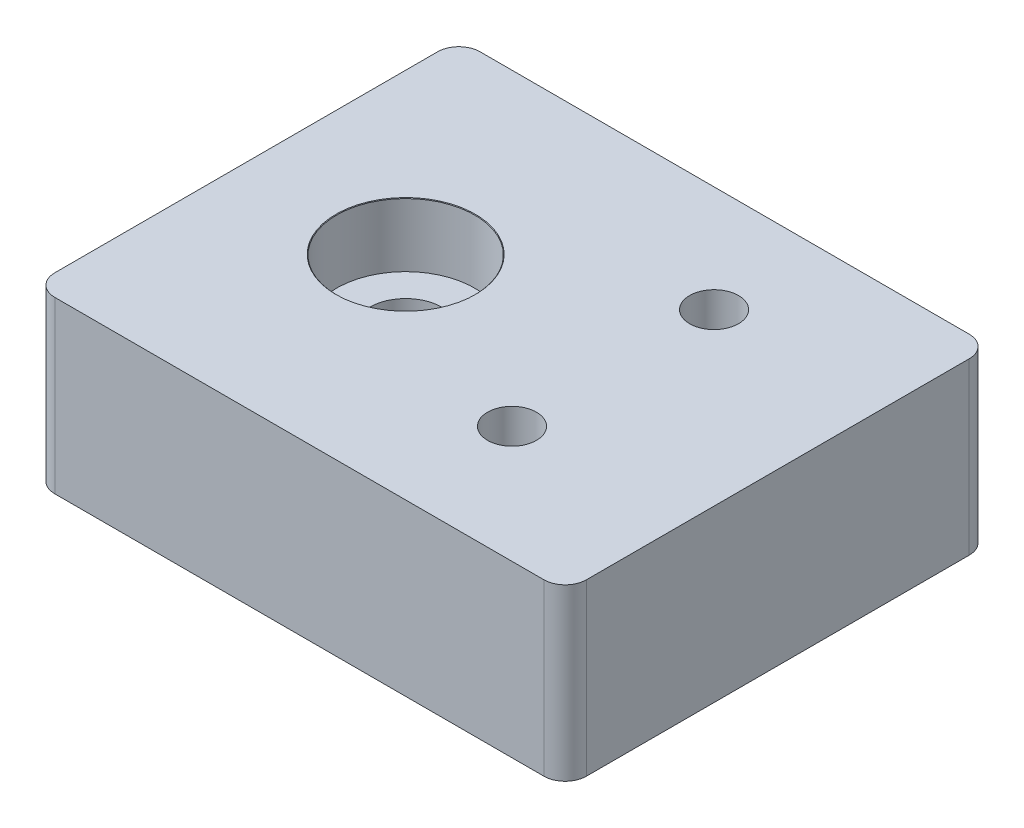
ISO-10303-21;
HEADER;
FILE_DESCRIPTION(('STEP AP214'),'2;1');
FILE_NAME('part.step','',(''),(''),'','','');
FILE_SCHEMA(('AUTOMOTIVE_DESIGN { 1 0 10303 214 1 1 1 1 }'));
ENDSEC;
DATA;
#1=APPLICATION_CONTEXT('core data for automotive mechanical design processes');
#2=APPLICATION_PROTOCOL_DEFINITION('international standard','automotive_design',2000,#1);
#3=PRODUCT_CONTEXT('',#1,'mechanical');
#4=PRODUCT('Part','Part','',(#3));
#5=PRODUCT_RELATED_PRODUCT_CATEGORY('part','',(#4));
#6=PRODUCT_DEFINITION_FORMATION('','',#4);
#7=PRODUCT_DEFINITION_CONTEXT('part definition',#1,'design');
#8=PRODUCT_DEFINITION('design','',#6,#7);
#9=PRODUCT_DEFINITION_SHAPE('','',#8);
#10=(LENGTH_UNIT() NAMED_UNIT(*) SI_UNIT(.MILLI.,.METRE.));
#11=(NAMED_UNIT(*) PLANE_ANGLE_UNIT() SI_UNIT($,.RADIAN.));
#12=(NAMED_UNIT(*) SI_UNIT($,.STERADIAN.) SOLID_ANGLE_UNIT());
#13=UNCERTAINTY_MEASURE_WITH_UNIT(LENGTH_MEASURE(1.E-05),#10,'distance_accuracy_value','');
#14=(GEOMETRIC_REPRESENTATION_CONTEXT(3) GLOBAL_UNCERTAINTY_ASSIGNED_CONTEXT((#13)) GLOBAL_UNIT_ASSIGNED_CONTEXT((#10,
#11,#12)) REPRESENTATION_CONTEXT('',''));
#15=CARTESIAN_POINT('',(0.,0.,0.));
#16=DIRECTION('',(0.,0.,1.));
#17=DIRECTION('',(1.,0.,0.));
#18=AXIS2_PLACEMENT_3D('',#15,#16,#17);
#19=CARTESIAN_POINT('',(-12.5,8.,-10.));
#20=DIRECTION('',(1.,0.,0.));
#21=DIRECTION('',(0.,0.,-1.));
#22=AXIS2_PLACEMENT_3D('',#19,#20,#21);
#23=PLANE('',#22);
#24=DIRECTION('',(0.,0.,1.));
#25=VECTOR('',#24,1.);
#26=CARTESIAN_POINT('',(-12.5,0.,-10.));
#27=LINE('',#26,#25);
#28=CARTESIAN_POINT('',(-12.5,0.,-9.));
#29=VERTEX_POINT('',#28);
#30=CARTESIAN_POINT('',(-12.5,0.,9.));
#31=VERTEX_POINT('',#30);
#32=EDGE_CURVE('E138',#29,#31,#27,.T.);
#33=ORIENTED_EDGE('',*,*,#32,.T.);
#34=DIRECTION('',(0.,-1.,0.));
#35=VECTOR('',#34,1.);
#36=CARTESIAN_POINT('',(-12.5,8.,9.));
#37=LINE('',#36,#35);
#38=CARTESIAN_POINT('',(-12.5,8.,9.));
#39=VERTEX_POINT('',#38);
#40=EDGE_CURVE('E160',#31,#39,#37,.F.);
#41=ORIENTED_EDGE('',*,*,#40,.T.);
#42=DIRECTION('',(0.,0.,1.));
#43=VECTOR('',#42,1.);
#44=CARTESIAN_POINT('',(-12.5,8.,-10.));
#45=LINE('',#44,#43);
#46=CARTESIAN_POINT('',(-12.5,8.,-9.));
#47=VERTEX_POINT('',#46);
#48=EDGE_CURVE('E136',#47,#39,#45,.T.);
#49=ORIENTED_EDGE('',*,*,#48,.F.);
#50=DIRECTION('',(0.,-1.,0.));
#51=VECTOR('',#50,1.);
#52=CARTESIAN_POINT('',(-12.5,8.,-9.));
#53=LINE('',#52,#51);
#54=EDGE_CURVE('E157',#47,#29,#53,.T.);
#55=ORIENTED_EDGE('',*,*,#54,.T.);
#56=EDGE_LOOP('',(#33,#41,#49,#55));
#57=FACE_BOUND('',#56,.T.);
#58=ADVANCED_FACE('F41',(#57),#23,.F.);
#59=CARTESIAN_POINT('',(12.5,8.,10.));
#60=DIRECTION('',(0.,0.,-1.));
#61=DIRECTION('',(-1.,0.,0.));
#62=AXIS2_PLACEMENT_3D('',#59,#60,#61);
#63=PLANE('',#62);
#64=DIRECTION('',(1.,0.,0.));
#65=VECTOR('',#64,1.);
#66=CARTESIAN_POINT('',(12.5,0.,10.));
#67=LINE('',#66,#65);
#68=CARTESIAN_POINT('',(-11.5,0.,10.));
#69=VERTEX_POINT('',#68);
#70=CARTESIAN_POINT('',(11.5,0.,10.));
#71=VERTEX_POINT('',#70);
#72=EDGE_CURVE('E134',#69,#71,#67,.T.);
#73=ORIENTED_EDGE('',*,*,#72,.T.);
#74=DIRECTION('',(0.,-1.,0.));
#75=VECTOR('',#74,1.);
#76=CARTESIAN_POINT('',(11.5,8.,10.));
#77=LINE('',#76,#75);
#78=CARTESIAN_POINT('',(11.5,8.,10.));
#79=VERTEX_POINT('',#78);
#80=EDGE_CURVE('E112',#71,#79,#77,.F.);
#81=ORIENTED_EDGE('',*,*,#80,.T.);
#82=DIRECTION('',(1.,0.,0.));
#83=VECTOR('',#82,1.);
#84=CARTESIAN_POINT('',(12.5,8.,10.));
#85=LINE('',#84,#83);
#86=CARTESIAN_POINT('',(-11.5,8.,10.));
#87=VERTEX_POINT('',#86);
#88=EDGE_CURVE('E174',#87,#79,#85,.T.);
#89=ORIENTED_EDGE('',*,*,#88,.F.);
#90=DIRECTION('',(0.,-1.,0.));
#91=VECTOR('',#90,1.);
#92=CARTESIAN_POINT('',(-11.5,8.,10.));
#93=LINE('',#92,#91);
#94=EDGE_CURVE('E117',#87,#69,#93,.T.);
#95=ORIENTED_EDGE('',*,*,#94,.T.);
#96=EDGE_LOOP('',(#73,#81,#89,#95));
#97=FACE_BOUND('',#96,.T.);
#98=ADVANCED_FACE('F179',(#97),#63,.F.);
#99=CARTESIAN_POINT('',(12.5,8.,-10.));
#100=DIRECTION('',(-1.,0.,0.));
#101=DIRECTION('',(0.,0.,1.));
#102=AXIS2_PLACEMENT_3D('',#99,#100,#101);
#103=PLANE('',#102);
#104=DIRECTION('',(0.,0.,-1.));
#105=VECTOR('',#104,1.);
#106=CARTESIAN_POINT('',(12.5,8.,-10.));
#107=LINE('',#106,#105);
#108=CARTESIAN_POINT('',(12.5,8.,9.));
#109=VERTEX_POINT('',#108);
#110=CARTESIAN_POINT('',(12.5,8.,-9.00000000000001));
#111=VERTEX_POINT('',#110);
#112=EDGE_CURVE('E126',#109,#111,#107,.T.);
#113=ORIENTED_EDGE('',*,*,#112,.F.);
#114=DIRECTION('',(0.,-1.,0.));
#115=VECTOR('',#114,1.);
#116=CARTESIAN_POINT('',(12.5,8.,9.));
#117=LINE('',#116,#115);
#118=CARTESIAN_POINT('',(12.5,0.,9.));
#119=VERTEX_POINT('',#118);
#120=EDGE_CURVE('E111',#109,#119,#117,.T.);
#121=ORIENTED_EDGE('',*,*,#120,.T.);
#122=DIRECTION('',(0.,0.,-1.));
#123=VECTOR('',#122,1.);
#124=CARTESIAN_POINT('',(12.5,0.,-10.));
#125=LINE('',#124,#123);
#126=CARTESIAN_POINT('',(12.5,0.,-9.00000000000001));
#127=VERTEX_POINT('',#126);
#128=EDGE_CURVE('E124',#119,#127,#125,.T.);
#129=ORIENTED_EDGE('',*,*,#128,.T.);
#130=DIRECTION('',(0.,-1.,0.));
#131=VECTOR('',#130,1.);
#132=CARTESIAN_POINT('',(12.5,8.,-9.00000000000001));
#133=LINE('',#132,#131);
#134=EDGE_CURVE('E128',#127,#111,#133,.F.);
#135=ORIENTED_EDGE('',*,*,#134,.T.);
#136=EDGE_LOOP('',(#113,#121,#129,#135));
#137=FACE_BOUND('',#136,.T.);
#138=ADVANCED_FACE('F123',(#137),#103,.F.);
#139=CARTESIAN_POINT('',(12.5,8.,-10.));
#140=DIRECTION('',(0.,0.,1.));
#141=DIRECTION('',(1.,0.,0.));
#142=AXIS2_PLACEMENT_3D('',#139,#140,#141);
#143=PLANE('',#142);
#144=DIRECTION('',(-1.,0.,0.));
#145=VECTOR('',#144,1.);
#146=CARTESIAN_POINT('',(12.5,8.,-10.));
#147=LINE('',#146,#145);
#148=CARTESIAN_POINT('',(11.5,8.,-10.));
#149=VERTEX_POINT('',#148);
#150=CARTESIAN_POINT('',(-11.5,8.,-10.));
#151=VERTEX_POINT('',#150);
#152=EDGE_CURVE('E142',#149,#151,#147,.T.);
#153=ORIENTED_EDGE('',*,*,#152,.F.);
#154=DIRECTION('',(0.,-1.,0.));
#155=VECTOR('',#154,1.);
#156=CARTESIAN_POINT('',(11.5,8.,-10.));
#157=LINE('',#156,#155);
#158=CARTESIAN_POINT('',(11.5,0.,-10.));
#159=VERTEX_POINT('',#158);
#160=EDGE_CURVE('E11',#149,#159,#157,.T.);
#161=ORIENTED_EDGE('',*,*,#160,.T.);
#162=DIRECTION('',(-1.,0.,0.));
#163=VECTOR('',#162,1.);
#164=CARTESIAN_POINT('',(12.5,0.,-10.));
#165=LINE('',#164,#163);
#166=CARTESIAN_POINT('',(-11.5,0.,-10.));
#167=VERTEX_POINT('',#166);
#168=EDGE_CURVE('E133',#159,#167,#165,.T.);
#169=ORIENTED_EDGE('',*,*,#168,.T.);
#170=DIRECTION('',(0.,-1.,0.));
#171=VECTOR('',#170,1.);
#172=CARTESIAN_POINT('',(-11.5,8.,-10.));
#173=LINE('',#172,#171);
#174=EDGE_CURVE('E49',#167,#151,#173,.F.);
#175=ORIENTED_EDGE('',*,*,#174,.T.);
#176=EDGE_LOOP('',(#153,#161,#169,#175));
#177=FACE_BOUND('',#176,.T.);
#178=ADVANCED_FACE('F223',(#177),#143,.F.);
#179=CARTESIAN_POINT('',(0.,8.,0.));
#180=DIRECTION('',(0.,-1.,0.));
#181=DIRECTION('',(0.,0.,-1.));
#182=AXIS2_PLACEMENT_3D('',#179,#180,#181);
#183=PLANE('',#182);
#184=CARTESIAN_POINT('',(4.50000000000001,8.,-5.00000000000001));
#185=DIRECTION('',(0.,1.,0.));
#186=DIRECTION('',(0.,0.,1.));
#187=AXIS2_PLACEMENT_3D('',#184,#185,#186);
#188=CIRCLE('',#187,1.15);
#189=CARTESIAN_POINT('',(4.50000000000001,8.,-3.85000000000001));
#190=VERTEX_POINT('',#189);
#191=EDGE_CURVE('E206',#190,#190,#188,.T.);
#192=ORIENTED_EDGE('',*,*,#191,.F.);
#193=EDGE_LOOP('',(#192));
#194=FACE_BOUND('',#193,.T.);
#195=CARTESIAN_POINT('',(4.50000000000001,8.,4.5));
#196=DIRECTION('',(0.,1.,0.));
#197=DIRECTION('',(0.,0.,1.));
#198=AXIS2_PLACEMENT_3D('',#195,#196,#197);
#199=CIRCLE('',#198,1.15);
#200=CARTESIAN_POINT('',(4.50000000000001,8.,5.65));
#201=VERTEX_POINT('',#200);
#202=EDGE_CURVE('E203',#201,#201,#199,.T.);
#203=ORIENTED_EDGE('',*,*,#202,.F.);
#204=EDGE_LOOP('',(#203));
#205=FACE_BOUND('',#204,.T.);
#206=CARTESIAN_POINT('',(-5.,8.,0.));
#207=DIRECTION('',(0.,1.,0.));
#208=DIRECTION('',(0.,0.,1.));
#209=AXIS2_PLACEMENT_3D('',#206,#207,#208);
#210=CIRCLE('',#209,3.275);
#211=CARTESIAN_POINT('',(-5.,8.,3.275));
#212=VERTEX_POINT('',#211);
#213=EDGE_CURVE('E196',#212,#212,#210,.T.);
#214=ORIENTED_EDGE('',*,*,#213,.F.);
#215=EDGE_LOOP('',(#214));
#216=FACE_BOUND('',#215,.T.);
#217=ORIENTED_EDGE('',*,*,#88,.T.);
#218=CARTESIAN_POINT('',(11.5,8.,9.));
#219=DIRECTION('',(0.,-1.,0.));
#220=DIRECTION('',(0.,0.,-1.));
#221=AXIS2_PLACEMENT_3D('',#218,#219,#220);
#222=CIRCLE('',#221,1.);
#223=EDGE_CURVE('E155',#79,#109,#222,.F.);
#224=ORIENTED_EDGE('',*,*,#223,.T.);
#225=ORIENTED_EDGE('',*,*,#112,.T.);
#226=CARTESIAN_POINT('',(11.5,8.,-9.00000000000001));
#227=DIRECTION('',(0.,-1.,0.));
#228=DIRECTION('',(0.,0.,-1.));
#229=AXIS2_PLACEMENT_3D('',#226,#227,#228);
#230=CIRCLE('',#229,1.);
#231=EDGE_CURVE('E62',#111,#149,#230,.F.);
#232=ORIENTED_EDGE('',*,*,#231,.T.);
#233=ORIENTED_EDGE('',*,*,#152,.T.);
#234=CARTESIAN_POINT('',(-11.5,8.,-9.));
#235=DIRECTION('',(0.,-1.,0.));
#236=DIRECTION('',(0.,0.,-1.));
#237=AXIS2_PLACEMENT_3D('',#234,#235,#236);
#238=CIRCLE('',#237,1.);
#239=EDGE_CURVE('E150',#151,#47,#238,.F.);
#240=ORIENTED_EDGE('',*,*,#239,.T.);
#241=ORIENTED_EDGE('',*,*,#48,.T.);
#242=CARTESIAN_POINT('',(-11.5,8.,9.));
#243=DIRECTION('',(0.,-1.,0.));
#244=DIRECTION('',(0.,0.,-1.));
#245=AXIS2_PLACEMENT_3D('',#242,#243,#244);
#246=CIRCLE('',#245,1.);
#247=EDGE_CURVE('E153',#39,#87,#246,.F.);
#248=ORIENTED_EDGE('',*,*,#247,.T.);
#249=EDGE_LOOP('',(#217,#224,#225,#232,#233,#240,#241,#248));
#250=FACE_BOUND('',#249,.T.);
#251=ADVANCED_FACE('F171',(#194,#205,#216,#250),#183,.F.);
#252=CARTESIAN_POINT('',(0.,0.,0.));
#253=DIRECTION('',(0.,-1.,0.));
#254=DIRECTION('',(0.,0.,-1.));
#255=AXIS2_PLACEMENT_3D('',#252,#253,#254);
#256=PLANE('',#255);
#257=CARTESIAN_POINT('',(-5.,0.,0.));
#258=DIRECTION('',(0.,1.,0.));
#259=DIRECTION('',(0.,0.,1.));
#260=AXIS2_PLACEMENT_3D('',#257,#258,#259);
#261=CIRCLE('',#260,1.7);
#262=CARTESIAN_POINT('',(-5.,0.,1.7));
#263=VERTEX_POINT('',#262);
#264=EDGE_CURVE('E180',#263,#263,#261,.T.);
#265=ORIENTED_EDGE('',*,*,#264,.T.);
#266=EDGE_LOOP('',(#265));
#267=FACE_BOUND('',#266,.T.);
#268=ORIENTED_EDGE('',*,*,#128,.F.);
#269=CARTESIAN_POINT('',(11.5,0.,9.));
#270=DIRECTION('',(0.,-1.,0.));
#271=DIRECTION('',(0.,0.,-1.));
#272=AXIS2_PLACEMENT_3D('',#269,#270,#271);
#273=CIRCLE('',#272,1.);
#274=EDGE_CURVE('E107',#119,#71,#273,.T.);
#275=ORIENTED_EDGE('',*,*,#274,.T.);
#276=ORIENTED_EDGE('',*,*,#72,.F.);
#277=CARTESIAN_POINT('',(-11.5,0.,9.));
#278=DIRECTION('',(0.,-1.,0.));
#279=DIRECTION('',(0.,0.,-1.));
#280=AXIS2_PLACEMENT_3D('',#277,#278,#279);
#281=CIRCLE('',#280,1.);
#282=EDGE_CURVE('E118',#69,#31,#281,.T.);
#283=ORIENTED_EDGE('',*,*,#282,.T.);
#284=ORIENTED_EDGE('',*,*,#32,.F.);
#285=CARTESIAN_POINT('',(-11.5,0.,-9.));
#286=DIRECTION('',(0.,-1.,0.));
#287=DIRECTION('',(0.,0.,-1.));
#288=AXIS2_PLACEMENT_3D('',#285,#286,#287);
#289=CIRCLE('',#288,1.);
#290=EDGE_CURVE('E127',#29,#167,#289,.T.);
#291=ORIENTED_EDGE('',*,*,#290,.T.);
#292=ORIENTED_EDGE('',*,*,#168,.F.);
#293=CARTESIAN_POINT('',(11.5,0.,-9.00000000000001));
#294=DIRECTION('',(0.,-1.,0.));
#295=DIRECTION('',(0.,0.,-1.));
#296=AXIS2_PLACEMENT_3D('',#293,#294,#295);
#297=CIRCLE('',#296,1.);
#298=EDGE_CURVE('E132',#159,#127,#297,.T.);
#299=ORIENTED_EDGE('',*,*,#298,.T.);
#300=EDGE_LOOP('',(#268,#275,#276,#283,#284,#291,#292,#299));
#301=FACE_BOUND('',#300,.T.);
#302=ADVANCED_FACE('F130',(#267,#301),#256,.T.);
#303=CARTESIAN_POINT('',(-5.,8.,0.));
#304=DIRECTION('',(0.,1.,0.));
#305=DIRECTION('',(0.,0.,1.));
#306=AXIS2_PLACEMENT_3D('',#303,#304,#305);
#307=CYLINDRICAL_SURFACE('',#306,1.7);
#308=ORIENTED_EDGE('',*,*,#264,.F.);
#309=EDGE_LOOP('',(#308));
#310=FACE_BOUND('',#309,.T.);
#311=CARTESIAN_POINT('',(-5.,5.,0.));
#312=DIRECTION('',(0.,1.,0.));
#313=DIRECTION('',(0.,0.,1.));
#314=AXIS2_PLACEMENT_3D('',#311,#312,#313);
#315=CIRCLE('',#314,1.7);
#316=CARTESIAN_POINT('',(-5.,5.,1.7));
#317=VERTEX_POINT('',#316);
#318=EDGE_CURVE('E182',#317,#317,#315,.T.);
#319=ORIENTED_EDGE('',*,*,#318,.T.);
#320=EDGE_LOOP('',(#319));
#321=FACE_BOUND('',#320,.T.);
#322=ADVANCED_FACE('F269',(#310,#321),#307,.F.);
#323=CARTESIAN_POINT('',(-1.75,5.,0.));
#324=DIRECTION('',(0.,-1.,0.));
#325=DIRECTION('',(0.,0.,-1.));
#326=AXIS2_PLACEMENT_3D('',#323,#324,#325);
#327=PLANE('',#326);
#328=ORIENTED_EDGE('',*,*,#318,.F.);
#329=EDGE_LOOP('',(#328));
#330=FACE_BOUND('',#329,.T.);
#331=CARTESIAN_POINT('',(-5.,5.,0.));
#332=DIRECTION('',(0.,1.,0.));
#333=DIRECTION('',(0.,0.,1.));
#334=AXIS2_PLACEMENT_3D('',#331,#332,#333);
#335=CIRCLE('',#334,3.25);
#336=CARTESIAN_POINT('',(-5.,5.,3.24999999999999));
#337=VERTEX_POINT('',#336);
#338=EDGE_CURVE('E190',#337,#337,#335,.T.);
#339=ORIENTED_EDGE('',*,*,#338,.T.);
#340=EDGE_LOOP('',(#339));
#341=FACE_BOUND('',#340,.T.);
#342=ADVANCED_FACE('F239',(#330,#341),#327,.F.);
#343=CARTESIAN_POINT('',(-5.,8.,0.));
#344=DIRECTION('',(0.,1.,0.));
#345=DIRECTION('',(0.,0.,1.));
#346=AXIS2_PLACEMENT_3D('',#343,#344,#345);
#347=CYLINDRICAL_SURFACE('',#346,3.25);
#348=ORIENTED_EDGE('',*,*,#338,.F.);
#349=EDGE_LOOP('',(#348));
#350=FACE_BOUND('',#349,.T.);
#351=CARTESIAN_POINT('',(-5.,7.975,0.));
#352=DIRECTION('',(0.,1.,0.));
#353=DIRECTION('',(0.,0.,1.));
#354=AXIS2_PLACEMENT_3D('',#351,#352,#353);
#355=CIRCLE('',#354,3.25);
#356=CARTESIAN_POINT('',(-5.,7.975,3.25));
#357=VERTEX_POINT('',#356);
#358=EDGE_CURVE('E193',#357,#357,#355,.T.);
#359=ORIENTED_EDGE('',*,*,#358,.T.);
#360=EDGE_LOOP('',(#359));
#361=FACE_BOUND('',#360,.T.);
#362=ADVANCED_FACE('F231',(#350,#361),#347,.F.);
#363=CARTESIAN_POINT('',(-5.,8.,0.));
#364=DIRECTION('',(0.,1.,0.));
#365=DIRECTION('',(0.,0.,1.));
#366=AXIS2_PLACEMENT_3D('',#363,#364,#365);
#367=CONICAL_SURFACE('',#366,3.275,0.785398163397379);
#368=ORIENTED_EDGE('',*,*,#358,.F.);
#369=EDGE_LOOP('',(#368));
#370=FACE_BOUND('',#369,.T.);
#371=ORIENTED_EDGE('',*,*,#213,.T.);
#372=EDGE_LOOP('',(#371));
#373=FACE_BOUND('',#372,.T.);
#374=ADVANCED_FACE('F229',(#370,#373),#367,.F.);
#375=CARTESIAN_POINT('',(11.5,8.,9.));
#376=DIRECTION('',(0.,-1.,0.));
#377=DIRECTION('',(0.,0.,-1.));
#378=AXIS2_PLACEMENT_3D('',#375,#376,#377);
#379=CYLINDRICAL_SURFACE('',#378,1.);
#380=ORIENTED_EDGE('',*,*,#223,.F.);
#381=ORIENTED_EDGE('',*,*,#80,.F.);
#382=ORIENTED_EDGE('',*,*,#274,.F.);
#383=ORIENTED_EDGE('',*,*,#120,.F.);
#384=EDGE_LOOP('',(#380,#381,#382,#383));
#385=FACE_BOUND('',#384,.T.);
#386=ADVANCED_FACE('F110',(#385),#379,.T.);
#387=CARTESIAN_POINT('',(-11.5,8.,9.));
#388=DIRECTION('',(0.,-1.,0.));
#389=DIRECTION('',(0.,0.,-1.));
#390=AXIS2_PLACEMENT_3D('',#387,#388,#389);
#391=CYLINDRICAL_SURFACE('',#390,1.);
#392=ORIENTED_EDGE('',*,*,#247,.F.);
#393=ORIENTED_EDGE('',*,*,#40,.F.);
#394=ORIENTED_EDGE('',*,*,#282,.F.);
#395=ORIENTED_EDGE('',*,*,#94,.F.);
#396=EDGE_LOOP('',(#392,#393,#394,#395));
#397=FACE_BOUND('',#396,.T.);
#398=ADVANCED_FACE('F177',(#397),#391,.T.);
#399=CARTESIAN_POINT('',(11.5,8.,-9.00000000000001));
#400=DIRECTION('',(0.,-1.,0.));
#401=DIRECTION('',(0.,0.,-1.));
#402=AXIS2_PLACEMENT_3D('',#399,#400,#401);
#403=CYLINDRICAL_SURFACE('',#402,1.);
#404=ORIENTED_EDGE('',*,*,#231,.F.);
#405=ORIENTED_EDGE('',*,*,#134,.F.);
#406=ORIENTED_EDGE('',*,*,#298,.F.);
#407=ORIENTED_EDGE('',*,*,#160,.F.);
#408=EDGE_LOOP('',(#404,#405,#406,#407));
#409=FACE_BOUND('',#408,.T.);
#410=ADVANCED_FACE('F253',(#409),#403,.T.);
#411=CARTESIAN_POINT('',(-11.5,8.,-9.));
#412=DIRECTION('',(0.,-1.,0.));
#413=DIRECTION('',(0.,0.,-1.));
#414=AXIS2_PLACEMENT_3D('',#411,#412,#413);
#415=CYLINDRICAL_SURFACE('',#414,1.);
#416=ORIENTED_EDGE('',*,*,#239,.F.);
#417=ORIENTED_EDGE('',*,*,#174,.F.);
#418=ORIENTED_EDGE('',*,*,#290,.F.);
#419=ORIENTED_EDGE('',*,*,#54,.F.);
#420=EDGE_LOOP('',(#416,#417,#418,#419));
#421=FACE_BOUND('',#420,.T.);
#422=ADVANCED_FACE('F43',(#421),#415,.T.);
#423=CARTESIAN_POINT('',(4.50000000000001,3.,4.5));
#424=DIRECTION('',(0.,1.,0.));
#425=DIRECTION('',(0.,0.,1.));
#426=AXIS2_PLACEMENT_3D('',#423,#424,#425);
#427=CYLINDRICAL_SURFACE('',#426,1.15);
#428=CARTESIAN_POINT('',(4.50000000000001,3.,4.5));
#429=DIRECTION('',(0.,1.,0.));
#430=DIRECTION('',(0.,0.,1.));
#431=AXIS2_PLACEMENT_3D('',#428,#429,#430);
#432=CIRCLE('',#431,1.15);
#433=CARTESIAN_POINT('',(4.50000000000001,3.,5.65));
#434=VERTEX_POINT('',#433);
#435=EDGE_CURVE('E200',#434,#434,#432,.T.);
#436=ORIENTED_EDGE('',*,*,#435,.F.);
#437=EDGE_LOOP('',(#436));
#438=FACE_BOUND('',#437,.T.);
#439=ORIENTED_EDGE('',*,*,#202,.T.);
#440=EDGE_LOOP('',(#439));
#441=FACE_BOUND('',#440,.T.);
#442=ADVANCED_FACE('F259',(#438,#441),#427,.F.);
#443=CARTESIAN_POINT('',(4.50000000000001,3.,4.5));
#444=DIRECTION('',(0.,1.,0.));
#445=DIRECTION('',(0.,0.,1.));
#446=AXIS2_PLACEMENT_3D('',#443,#444,#445);
#447=PLANE('',#446);
#448=ORIENTED_EDGE('',*,*,#435,.T.);
#449=EDGE_LOOP('',(#448));
#450=FACE_BOUND('',#449,.T.);
#451=ADVANCED_FACE('F217',(#450),#447,.T.);
#452=CARTESIAN_POINT('',(4.50000000000001,3.,-5.00000000000001));
#453=DIRECTION('',(0.,1.,0.));
#454=DIRECTION('',(0.,0.,1.));
#455=AXIS2_PLACEMENT_3D('',#452,#453,#454);
#456=CYLINDRICAL_SURFACE('',#455,1.15);
#457=CARTESIAN_POINT('',(4.50000000000001,3.,-5.00000000000001));
#458=DIRECTION('',(0.,1.,0.));
#459=DIRECTION('',(0.,0.,1.));
#460=AXIS2_PLACEMENT_3D('',#457,#458,#459);
#461=CIRCLE('',#460,1.15);
#462=CARTESIAN_POINT('',(4.50000000000001,3.,-3.85000000000001));
#463=VERTEX_POINT('',#462);
#464=EDGE_CURVE('E199',#463,#463,#461,.T.);
#465=ORIENTED_EDGE('',*,*,#464,.F.);
#466=EDGE_LOOP('',(#465));
#467=FACE_BOUND('',#466,.T.);
#468=ORIENTED_EDGE('',*,*,#191,.T.);
#469=EDGE_LOOP('',(#468));
#470=FACE_BOUND('',#469,.T.);
#471=ADVANCED_FACE('F214',(#467,#470),#456,.F.);
#472=CARTESIAN_POINT('',(4.50000000000001,3.,-5.00000000000001));
#473=DIRECTION('',(0.,1.,0.));
#474=DIRECTION('',(0.,0.,1.));
#475=AXIS2_PLACEMENT_3D('',#472,#473,#474);
#476=PLANE('',#475);
#477=ORIENTED_EDGE('',*,*,#464,.T.);
#478=EDGE_LOOP('',(#477));
#479=FACE_BOUND('',#478,.T.);
#480=ADVANCED_FACE('F212',(#479),#476,.T.);
#481=CLOSED_SHELL('',(#58,#98,#138,#178,#251,#302,#322,#342,#362,#374,#386,#398,#410,#422,#442,
#451,#471,#480));
#482=MANIFOLD_SOLID_BREP('B2',#481);
#483=ADVANCED_BREP_SHAPE_REPRESENTATION('',(#18,#482),#14);
#484=SHAPE_DEFINITION_REPRESENTATION(#9,#483);
ENDSEC;
END-ISO-10303-21;
